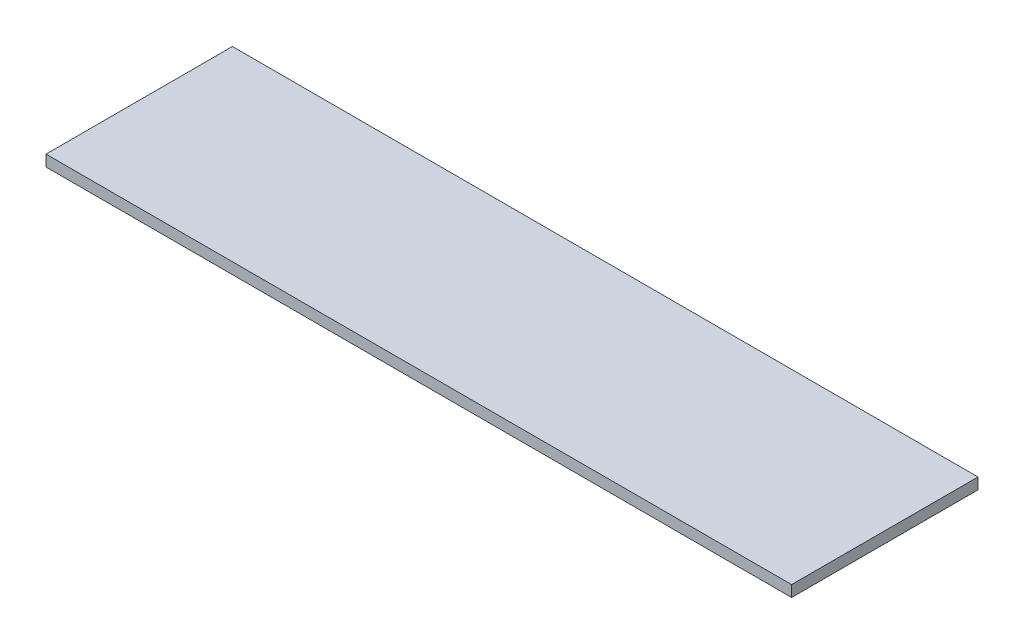
ISO-10303-21;
HEADER;
FILE_DESCRIPTION(('STEP AP214'),'2;1');
FILE_NAME('part.step','',(''),(''),'','','');
FILE_SCHEMA(('AUTOMOTIVE_DESIGN { 1 0 10303 214 1 1 1 1 }'));
ENDSEC;
DATA;
#1=APPLICATION_CONTEXT('core data for automotive mechanical design processes');
#2=APPLICATION_PROTOCOL_DEFINITION('international standard','automotive_design',2000,#1);
#3=PRODUCT_CONTEXT('',#1,'mechanical');
#4=PRODUCT('Part','Part','',(#3));
#5=PRODUCT_RELATED_PRODUCT_CATEGORY('part','',(#4));
#6=PRODUCT_DEFINITION_FORMATION('','',#4);
#7=PRODUCT_DEFINITION_CONTEXT('part definition',#1,'design');
#8=PRODUCT_DEFINITION('design','',#6,#7);
#9=PRODUCT_DEFINITION_SHAPE('','',#8);
#10=(LENGTH_UNIT() NAMED_UNIT(*) SI_UNIT(.MILLI.,.METRE.));
#11=(NAMED_UNIT(*) PLANE_ANGLE_UNIT() SI_UNIT($,.RADIAN.));
#12=(NAMED_UNIT(*) SI_UNIT($,.STERADIAN.) SOLID_ANGLE_UNIT());
#13=UNCERTAINTY_MEASURE_WITH_UNIT(LENGTH_MEASURE(1.E-05),#10,'distance_accuracy_value','');
#14=(GEOMETRIC_REPRESENTATION_CONTEXT(3) GLOBAL_UNCERTAINTY_ASSIGNED_CONTEXT((#13)) GLOBAL_UNIT_ASSIGNED_CONTEXT((#10,
#11,#12)) REPRESENTATION_CONTEXT('',''));
#15=CARTESIAN_POINT('',(0.,0.,0.));
#16=DIRECTION('',(0.,0.,1.));
#17=DIRECTION('',(1.,0.,0.));
#18=AXIS2_PLACEMENT_3D('',#15,#16,#17);
#19=CARTESIAN_POINT('',(50.,1.5,-12.5));
#20=DIRECTION('',(-1.,0.,0.));
#21=DIRECTION('',(0.,0.,1.));
#22=AXIS2_PLACEMENT_3D('',#19,#20,#21);
#23=PLANE('',#22);
#24=DIRECTION('',(0.,0.,-1.));
#25=VECTOR('',#24,1.);
#26=CARTESIAN_POINT('',(50.,0.,-12.5));
#27=LINE('',#26,#25);
#28=CARTESIAN_POINT('',(50.,0.,12.5));
#29=VERTEX_POINT('',#28);
#30=CARTESIAN_POINT('',(50.,0.,-12.5));
#31=VERTEX_POINT('',#30);
#32=EDGE_CURVE('E98',#29,#31,#27,.T.);
#33=ORIENTED_EDGE('',*,*,#32,.T.);
#34=DIRECTION('',(0.,-1.,0.));
#35=VECTOR('',#34,1.);
#36=CARTESIAN_POINT('',(50.,1.5,-12.5));
#37=LINE('',#36,#35);
#38=CARTESIAN_POINT('',(50.,1.5,-12.5));
#39=VERTEX_POINT('',#38);
#40=EDGE_CURVE('E11',#39,#31,#37,.T.);
#41=ORIENTED_EDGE('',*,*,#40,.F.);
#42=DIRECTION('',(0.,0.,-1.));
#43=VECTOR('',#42,1.);
#44=CARTESIAN_POINT('',(50.,1.5,-12.5));
#45=LINE('',#44,#43);
#46=CARTESIAN_POINT('',(50.,1.5,12.5));
#47=VERTEX_POINT('',#46);
#48=EDGE_CURVE('E86',#47,#39,#45,.T.);
#49=ORIENTED_EDGE('',*,*,#48,.F.);
#50=DIRECTION('',(0.,-1.,0.));
#51=VECTOR('',#50,1.);
#52=CARTESIAN_POINT('',(50.,1.5,12.5));
#53=LINE('',#52,#51);
#54=EDGE_CURVE('E94',#47,#29,#53,.T.);
#55=ORIENTED_EDGE('',*,*,#54,.T.);
#56=EDGE_LOOP('',(#33,#41,#49,#55));
#57=FACE_BOUND('',#56,.T.);
#58=ADVANCED_FACE('F35',(#57),#23,.F.);
#59=CARTESIAN_POINT('',(-50.,1.5,-12.5));
#60=DIRECTION('',(0.,0.,1.));
#61=DIRECTION('',(1.,0.,0.));
#62=AXIS2_PLACEMENT_3D('',#59,#60,#61);
#63=PLANE('',#62);
#64=DIRECTION('',(-1.,0.,0.));
#65=VECTOR('',#64,1.);
#66=CARTESIAN_POINT('',(-50.,0.,-12.5));
#67=LINE('',#66,#65);
#68=CARTESIAN_POINT('',(-50.,0.,-12.5));
#69=VERTEX_POINT('',#68);
#70=EDGE_CURVE('E90',#31,#69,#67,.T.);
#71=ORIENTED_EDGE('',*,*,#70,.T.);
#72=DIRECTION('',(0.,-1.,0.));
#73=VECTOR('',#72,1.);
#74=CARTESIAN_POINT('',(-50.,1.5,-12.5));
#75=LINE('',#74,#73);
#76=CARTESIAN_POINT('',(-50.,1.5,-12.5));
#77=VERTEX_POINT('',#76);
#78=EDGE_CURVE('E43',#77,#69,#75,.T.);
#79=ORIENTED_EDGE('',*,*,#78,.F.);
#80=DIRECTION('',(-1.,0.,0.));
#81=VECTOR('',#80,1.);
#82=CARTESIAN_POINT('',(-50.,1.5,-12.5));
#83=LINE('',#82,#81);
#84=EDGE_CURVE('E81',#39,#77,#83,.T.);
#85=ORIENTED_EDGE('',*,*,#84,.F.);
#86=ORIENTED_EDGE('',*,*,#40,.T.);
#87=EDGE_LOOP('',(#71,#79,#85,#86));
#88=FACE_BOUND('',#87,.T.);
#89=ADVANCED_FACE('F89',(#88),#63,.F.);
#90=CARTESIAN_POINT('',(-50.,1.5,-12.5));
#91=DIRECTION('',(1.,0.,0.));
#92=DIRECTION('',(0.,0.,-1.));
#93=AXIS2_PLACEMENT_3D('',#90,#91,#92);
#94=PLANE('',#93);
#95=DIRECTION('',(0.,0.,1.));
#96=VECTOR('',#95,1.);
#97=CARTESIAN_POINT('',(-50.,0.,-12.5));
#98=LINE('',#97,#96);
#99=CARTESIAN_POINT('',(-50.,0.,12.5));
#100=VERTEX_POINT('',#99);
#101=EDGE_CURVE('E68',#69,#100,#98,.T.);
#102=ORIENTED_EDGE('',*,*,#101,.T.);
#103=DIRECTION('',(0.,-1.,0.));
#104=VECTOR('',#103,1.);
#105=CARTESIAN_POINT('',(-50.,1.5,12.5));
#106=LINE('',#105,#104);
#107=CARTESIAN_POINT('',(-50.,1.5,12.5));
#108=VERTEX_POINT('',#107);
#109=EDGE_CURVE('E91',#108,#100,#106,.T.);
#110=ORIENTED_EDGE('',*,*,#109,.F.);
#111=DIRECTION('',(0.,0.,1.));
#112=VECTOR('',#111,1.);
#113=CARTESIAN_POINT('',(-50.,1.5,-12.5));
#114=LINE('',#113,#112);
#115=EDGE_CURVE('E84',#77,#108,#114,.T.);
#116=ORIENTED_EDGE('',*,*,#115,.F.);
#117=ORIENTED_EDGE('',*,*,#78,.T.);
#118=EDGE_LOOP('',(#102,#110,#116,#117));
#119=FACE_BOUND('',#118,.T.);
#120=ADVANCED_FACE('F92',(#119),#94,.F.);
#121=CARTESIAN_POINT('',(-50.,1.5,12.5));
#122=DIRECTION('',(0.,0.,-1.));
#123=DIRECTION('',(-1.,0.,0.));
#124=AXIS2_PLACEMENT_3D('',#121,#122,#123);
#125=PLANE('',#124);
#126=DIRECTION('',(1.,0.,0.));
#127=VECTOR('',#126,1.);
#128=CARTESIAN_POINT('',(-50.,0.,12.5));
#129=LINE('',#128,#127);
#130=EDGE_CURVE('E74',#100,#29,#129,.T.);
#131=ORIENTED_EDGE('',*,*,#130,.T.);
#132=ORIENTED_EDGE('',*,*,#54,.F.);
#133=DIRECTION('',(1.,0.,0.));
#134=VECTOR('',#133,1.);
#135=CARTESIAN_POINT('',(-50.,1.5,12.5));
#136=LINE('',#135,#134);
#137=EDGE_CURVE('E51',#108,#47,#136,.T.);
#138=ORIENTED_EDGE('',*,*,#137,.F.);
#139=ORIENTED_EDGE('',*,*,#109,.T.);
#140=EDGE_LOOP('',(#131,#132,#138,#139));
#141=FACE_BOUND('',#140,.T.);
#142=ADVANCED_FACE('F105',(#141),#125,.F.);
#143=CARTESIAN_POINT('',(0.,1.5,0.));
#144=DIRECTION('',(0.,1.,0.));
#145=DIRECTION('',(0.,0.,1.));
#146=AXIS2_PLACEMENT_3D('',#143,#144,#145);
#147=PLANE('',#146);
#148=ORIENTED_EDGE('',*,*,#48,.T.);
#149=ORIENTED_EDGE('',*,*,#84,.T.);
#150=ORIENTED_EDGE('',*,*,#115,.T.);
#151=ORIENTED_EDGE('',*,*,#137,.T.);
#152=EDGE_LOOP('',(#148,#149,#150,#151));
#153=FACE_BOUND('',#152,.T.);
#154=ADVANCED_FACE('F82',(#153),#147,.T.);
#155=CARTESIAN_POINT('',(0.,0.,0.));
#156=DIRECTION('',(0.,1.,0.));
#157=DIRECTION('',(0.,0.,1.));
#158=AXIS2_PLACEMENT_3D('',#155,#156,#157);
#159=PLANE('',#158);
#160=ORIENTED_EDGE('',*,*,#32,.F.);
#161=ORIENTED_EDGE('',*,*,#130,.F.);
#162=ORIENTED_EDGE('',*,*,#101,.F.);
#163=ORIENTED_EDGE('',*,*,#70,.F.);
#164=EDGE_LOOP('',(#160,#161,#162,#163));
#165=FACE_BOUND('',#164,.T.);
#166=ADVANCED_FACE('F108',(#165),#159,.F.);
#167=CLOSED_SHELL('',(#58,#89,#120,#142,#154,#166));
#168=MANIFOLD_SOLID_BREP('B2',#167);
#169=ADVANCED_BREP_SHAPE_REPRESENTATION('',(#18,#168),#14);
#170=SHAPE_DEFINITION_REPRESENTATION(#9,#169);
ENDSEC;
END-ISO-10303-21;
